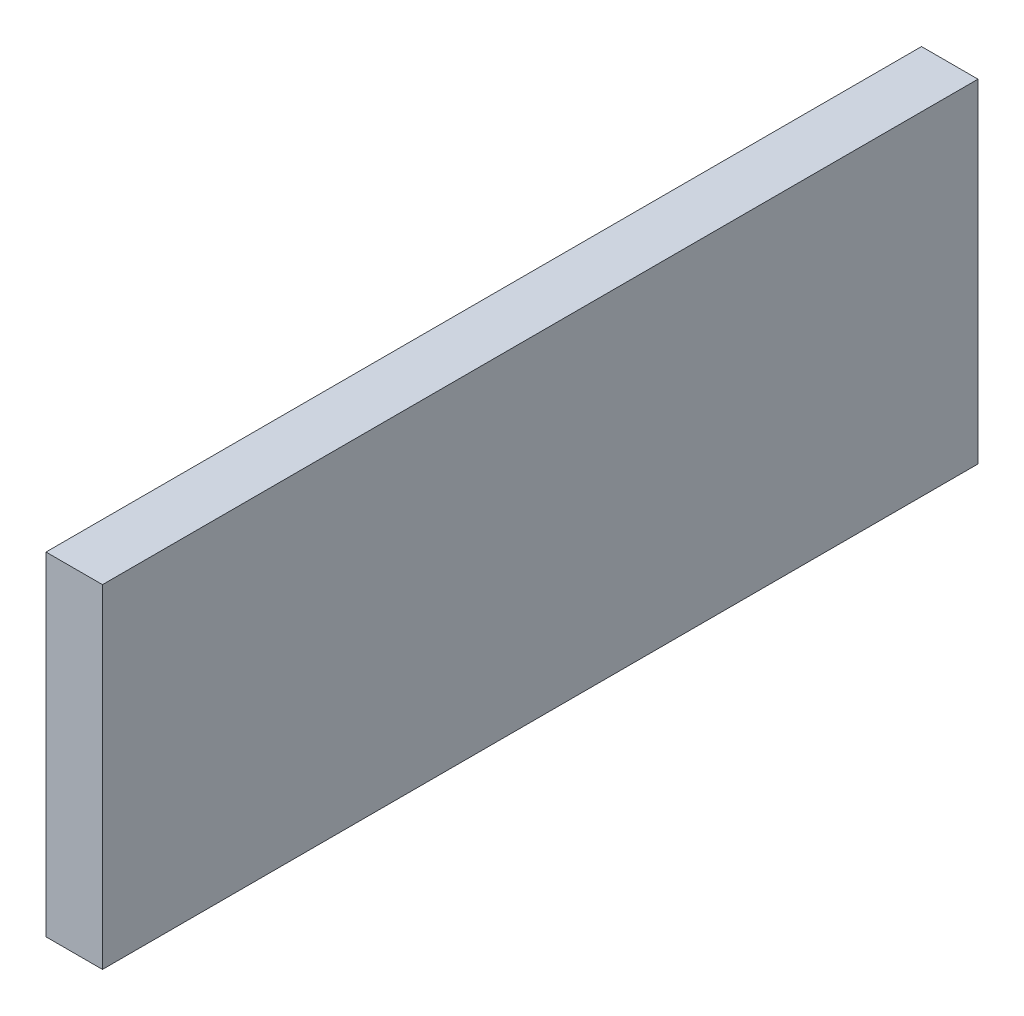
ISO-10303-21;
HEADER;
FILE_DESCRIPTION(('STEP AP214'),'2;1');
FILE_NAME('part.step','',(''),(''),'','','');
FILE_SCHEMA(('AUTOMOTIVE_DESIGN { 1 0 10303 214 1 1 1 1 }'));
ENDSEC;
DATA;
#1=APPLICATION_CONTEXT('core data for automotive mechanical design processes');
#2=APPLICATION_PROTOCOL_DEFINITION('international standard','automotive_design',2000,#1);
#3=PRODUCT_CONTEXT('',#1,'mechanical');
#4=PRODUCT('Part','Part','',(#3));
#5=PRODUCT_RELATED_PRODUCT_CATEGORY('part','',(#4));
#6=PRODUCT_DEFINITION_FORMATION('','',#4);
#7=PRODUCT_DEFINITION_CONTEXT('part definition',#1,'design');
#8=PRODUCT_DEFINITION('design','',#6,#7);
#9=PRODUCT_DEFINITION_SHAPE('','',#8);
#10=(LENGTH_UNIT() NAMED_UNIT(*) SI_UNIT(.MILLI.,.METRE.));
#11=(NAMED_UNIT(*) PLANE_ANGLE_UNIT() SI_UNIT($,.RADIAN.));
#12=(NAMED_UNIT(*) SI_UNIT($,.STERADIAN.) SOLID_ANGLE_UNIT());
#13=UNCERTAINTY_MEASURE_WITH_UNIT(LENGTH_MEASURE(1.E-05),#10,'distance_accuracy_value','');
#14=(GEOMETRIC_REPRESENTATION_CONTEXT(3) GLOBAL_UNCERTAINTY_ASSIGNED_CONTEXT((#13)) GLOBAL_UNIT_ASSIGNED_CONTEXT((#10,
#11,#12)) REPRESENTATION_CONTEXT('',''));
#15=CARTESIAN_POINT('',(0.,0.,0.));
#16=DIRECTION('',(0.,0.,1.));
#17=DIRECTION('',(1.,0.,0.));
#18=AXIS2_PLACEMENT_3D('',#15,#16,#17);
#19=CARTESIAN_POINT('',(-5.,29.5,155.));
#20=DIRECTION('',(1.,0.,0.));
#21=DIRECTION('',(0.,1.,0.));
#22=AXIS2_PLACEMENT_3D('',#19,#20,#21);
#23=PLANE('',#22);
#24=DIRECTION('',(0.,-1.,0.));
#25=VECTOR('',#24,1.);
#26=CARTESIAN_POINT('',(-5.,29.5,0.));
#27=LINE('',#26,#25);
#28=CARTESIAN_POINT('',(-5.,29.5,0.));
#29=VERTEX_POINT('',#28);
#30=CARTESIAN_POINT('',(-5.,-29.5,0.));
#31=VERTEX_POINT('',#30);
#32=EDGE_CURVE('E78',#29,#31,#27,.T.);
#33=ORIENTED_EDGE('',*,*,#32,.T.);
#34=DIRECTION('',(0.,0.,-1.));
#35=VECTOR('',#34,1.);
#36=CARTESIAN_POINT('',(-5.,-29.5,155.));
#37=LINE('',#36,#35);
#38=CARTESIAN_POINT('',(-5.,-29.5,155.));
#39=VERTEX_POINT('',#38);
#40=EDGE_CURVE('E11',#39,#31,#37,.T.);
#41=ORIENTED_EDGE('',*,*,#40,.F.);
#42=DIRECTION('',(0.,-1.,0.));
#43=VECTOR('',#42,1.);
#44=CARTESIAN_POINT('',(-5.,29.5,155.));
#45=LINE('',#44,#43);
#46=CARTESIAN_POINT('',(-5.,29.5,155.));
#47=VERTEX_POINT('',#46);
#48=EDGE_CURVE('E96',#47,#39,#45,.T.);
#49=ORIENTED_EDGE('',*,*,#48,.F.);
#50=DIRECTION('',(0.,0.,-1.));
#51=VECTOR('',#50,1.);
#52=CARTESIAN_POINT('',(-5.,29.5,155.));
#53=LINE('',#52,#51);
#54=EDGE_CURVE('E90',#47,#29,#53,.T.);
#55=ORIENTED_EDGE('',*,*,#54,.T.);
#56=EDGE_LOOP('',(#33,#41,#49,#55));
#57=FACE_BOUND('',#56,.T.);
#58=ADVANCED_FACE('F34',(#57),#23,.F.);
#59=CARTESIAN_POINT('',(-5.,-29.5,155.));
#60=DIRECTION('',(0.,1.,0.));
#61=DIRECTION('',(0.,0.,1.));
#62=AXIS2_PLACEMENT_3D('',#59,#60,#61);
#63=PLANE('',#62);
#64=DIRECTION('',(1.,0.,0.));
#65=VECTOR('',#64,1.);
#66=CARTESIAN_POINT('',(-5.,-29.5,0.));
#67=LINE('',#66,#65);
#68=CARTESIAN_POINT('',(5.,-29.5,0.));
#69=VERTEX_POINT('',#68);
#70=EDGE_CURVE('E74',#31,#69,#67,.T.);
#71=ORIENTED_EDGE('',*,*,#70,.T.);
#72=DIRECTION('',(0.,0.,-1.));
#73=VECTOR('',#72,1.);
#74=CARTESIAN_POINT('',(5.,-29.5,155.));
#75=LINE('',#74,#73);
#76=CARTESIAN_POINT('',(5.,-29.5,155.));
#77=VERTEX_POINT('',#76);
#78=EDGE_CURVE('E41',#77,#69,#75,.T.);
#79=ORIENTED_EDGE('',*,*,#78,.F.);
#80=DIRECTION('',(1.,0.,0.));
#81=VECTOR('',#80,1.);
#82=CARTESIAN_POINT('',(-5.,-29.5,155.));
#83=LINE('',#82,#81);
#84=EDGE_CURVE('E86',#39,#77,#83,.T.);
#85=ORIENTED_EDGE('',*,*,#84,.F.);
#86=ORIENTED_EDGE('',*,*,#40,.T.);
#87=EDGE_LOOP('',(#71,#79,#85,#86));
#88=FACE_BOUND('',#87,.T.);
#89=ADVANCED_FACE('F85',(#88),#63,.F.);
#90=CARTESIAN_POINT('',(5.,29.5,155.));
#91=DIRECTION('',(-1.,0.,0.));
#92=DIRECTION('',(0.,-1.,0.));
#93=AXIS2_PLACEMENT_3D('',#90,#91,#92);
#94=PLANE('',#93);
#95=DIRECTION('',(0.,1.,0.));
#96=VECTOR('',#95,1.);
#97=CARTESIAN_POINT('',(5.,29.5,0.));
#98=LINE('',#97,#96);
#99=CARTESIAN_POINT('',(5.,29.5,0.));
#100=VERTEX_POINT('',#99);
#101=EDGE_CURVE('E79',#69,#100,#98,.T.);
#102=ORIENTED_EDGE('',*,*,#101,.T.);
#103=DIRECTION('',(0.,0.,-1.));
#104=VECTOR('',#103,1.);
#105=CARTESIAN_POINT('',(5.,29.5,155.));
#106=LINE('',#105,#104);
#107=CARTESIAN_POINT('',(5.,29.5,155.));
#108=VERTEX_POINT('',#107);
#109=EDGE_CURVE('E102',#108,#100,#106,.T.);
#110=ORIENTED_EDGE('',*,*,#109,.F.);
#111=DIRECTION('',(0.,1.,0.));
#112=VECTOR('',#111,1.);
#113=CARTESIAN_POINT('',(5.,29.5,155.));
#114=LINE('',#113,#112);
#115=EDGE_CURVE('E53',#77,#108,#114,.T.);
#116=ORIENTED_EDGE('',*,*,#115,.F.);
#117=ORIENTED_EDGE('',*,*,#78,.T.);
#118=EDGE_LOOP('',(#102,#110,#116,#117));
#119=FACE_BOUND('',#118,.T.);
#120=ADVANCED_FACE('F105',(#119),#94,.F.);
#121=CARTESIAN_POINT('',(-5.,29.5,155.));
#122=DIRECTION('',(0.,-1.,0.));
#123=DIRECTION('',(0.,0.,-1.));
#124=AXIS2_PLACEMENT_3D('',#121,#122,#123);
#125=PLANE('',#124);
#126=DIRECTION('',(-1.,0.,0.));
#127=VECTOR('',#126,1.);
#128=CARTESIAN_POINT('',(-5.,29.5,0.));
#129=LINE('',#128,#127);
#130=EDGE_CURVE('E94',#100,#29,#129,.T.);
#131=ORIENTED_EDGE('',*,*,#130,.T.);
#132=ORIENTED_EDGE('',*,*,#54,.F.);
#133=DIRECTION('',(-1.,0.,0.));
#134=VECTOR('',#133,1.);
#135=CARTESIAN_POINT('',(-5.,29.5,155.));
#136=LINE('',#135,#134);
#137=EDGE_CURVE('E48',#108,#47,#136,.T.);
#138=ORIENTED_EDGE('',*,*,#137,.F.);
#139=ORIENTED_EDGE('',*,*,#109,.T.);
#140=EDGE_LOOP('',(#131,#132,#138,#139));
#141=FACE_BOUND('',#140,.T.);
#142=ADVANCED_FACE('F107',(#141),#125,.F.);
#143=CARTESIAN_POINT('',(-5.,-29.5,155.));
#144=DIRECTION('',(0.,0.,1.));
#145=DIRECTION('',(1.,0.,0.));
#146=AXIS2_PLACEMENT_3D('',#143,#144,#145);
#147=PLANE('',#146);
#148=ORIENTED_EDGE('',*,*,#48,.T.);
#149=ORIENTED_EDGE('',*,*,#84,.T.);
#150=ORIENTED_EDGE('',*,*,#115,.T.);
#151=ORIENTED_EDGE('',*,*,#137,.T.);
#152=EDGE_LOOP('',(#148,#149,#150,#151));
#153=FACE_BOUND('',#152,.T.);
#154=ADVANCED_FACE('F108',(#153),#147,.T.);
#155=CARTESIAN_POINT('',(-5.,-29.5,0.));
#156=DIRECTION('',(0.,0.,1.));
#157=DIRECTION('',(1.,0.,0.));
#158=AXIS2_PLACEMENT_3D('',#155,#156,#157);
#159=PLANE('',#158);
#160=ORIENTED_EDGE('',*,*,#32,.F.);
#161=ORIENTED_EDGE('',*,*,#130,.F.);
#162=ORIENTED_EDGE('',*,*,#101,.F.);
#163=ORIENTED_EDGE('',*,*,#70,.F.);
#164=EDGE_LOOP('',(#160,#161,#162,#163));
#165=FACE_BOUND('',#164,.T.);
#166=ADVANCED_FACE('F75',(#165),#159,.F.);
#167=CLOSED_SHELL('',(#58,#89,#120,#142,#154,#166));
#168=MANIFOLD_SOLID_BREP('B2',#167);
#169=ADVANCED_BREP_SHAPE_REPRESENTATION('',(#18,#168),#14);
#170=SHAPE_DEFINITION_REPRESENTATION(#9,#169);
ENDSEC;
END-ISO-10303-21;
